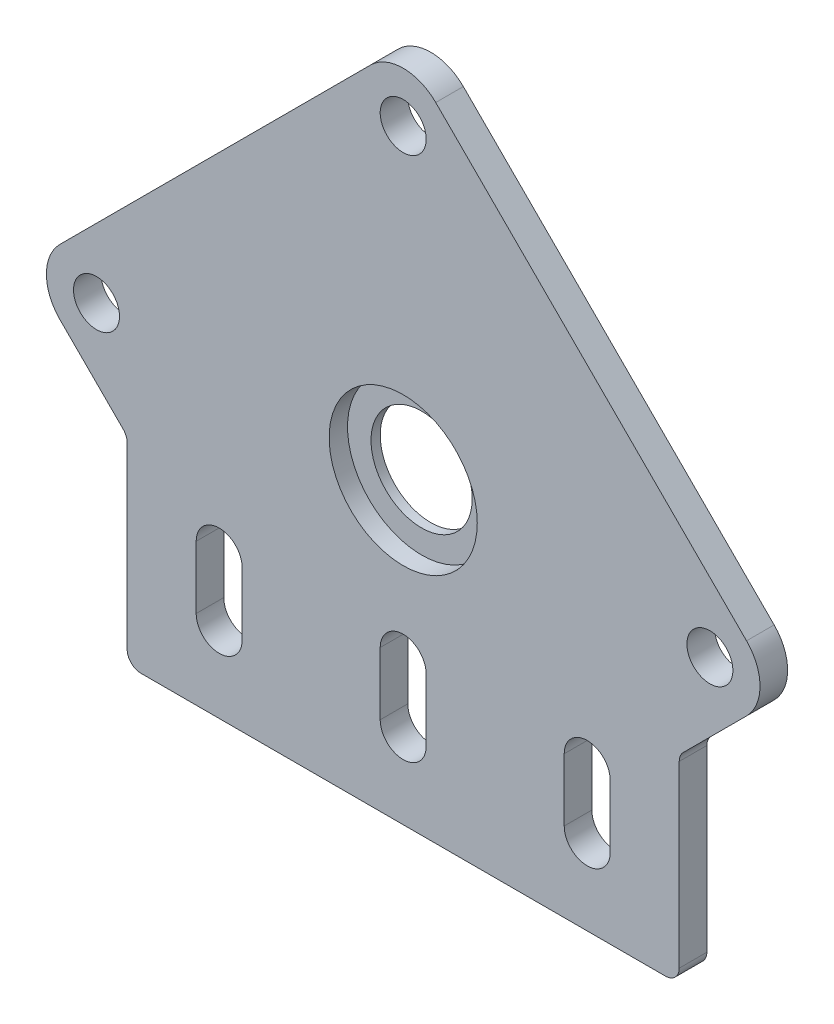
ISO-10303-21;
HEADER;
FILE_DESCRIPTION(('STEP AP214'),'2;1');
FILE_NAME('part.step','',(''),(''),'','','');
FILE_SCHEMA(('AUTOMOTIVE_DESIGN { 1 0 10303 214 1 1 1 1 }'));
ENDSEC;
DATA;
#1=APPLICATION_CONTEXT('core data for automotive mechanical design processes');
#2=APPLICATION_PROTOCOL_DEFINITION('international standard','automotive_design',2000,#1);
#3=PRODUCT_CONTEXT('',#1,'mechanical');
#4=PRODUCT('Part','Part','',(#3));
#5=PRODUCT_RELATED_PRODUCT_CATEGORY('part','',(#4));
#6=PRODUCT_DEFINITION_FORMATION('','',#4);
#7=PRODUCT_DEFINITION_CONTEXT('part definition',#1,'design');
#8=PRODUCT_DEFINITION('design','',#6,#7);
#9=PRODUCT_DEFINITION_SHAPE('','',#8);
#10=(LENGTH_UNIT() NAMED_UNIT(*) SI_UNIT(.MILLI.,.METRE.));
#11=(NAMED_UNIT(*) PLANE_ANGLE_UNIT() SI_UNIT($,.RADIAN.));
#12=(NAMED_UNIT(*) SI_UNIT($,.STERADIAN.) SOLID_ANGLE_UNIT());
#13=UNCERTAINTY_MEASURE_WITH_UNIT(LENGTH_MEASURE(1.E-05),#10,'distance_accuracy_value','');
#14=(GEOMETRIC_REPRESENTATION_CONTEXT(3) GLOBAL_UNCERTAINTY_ASSIGNED_CONTEXT((#13)) GLOBAL_UNIT_ASSIGNED_CONTEXT((#10,
#11,#12)) REPRESENTATION_CONTEXT('',''));
#15=CARTESIAN_POINT('',(0.,0.,0.));
#16=DIRECTION('',(0.,0.,1.));
#17=DIRECTION('',(1.,0.,0.));
#18=AXIS2_PLACEMENT_3D('',#15,#16,#17);
#19=CARTESIAN_POINT('',(0.,32.4299999999672,3.));
#20=DIRECTION('',(0.,0.,-1.));
#21=DIRECTION('',(-1.,0.,0.));
#22=AXIS2_PLACEMENT_3D('',#19,#20,#21);
#23=CYLINDRICAL_SURFACE('',#22,5.50000000000001);
#24=CARTESIAN_POINT('',(0.,32.4299999999672,0.));
#25=DIRECTION('',(0.,0.,1.));
#26=DIRECTION('',(1.,0.,0.));
#27=AXIS2_PLACEMENT_3D('',#24,#25,#26);
#28=CIRCLE('',#27,5.50000000000001);
#29=CARTESIAN_POINT('',(5.50000000000001,32.4299999999672,0.));
#30=VERTEX_POINT('',#29);
#31=EDGE_CURVE('E322',#30,#30,#28,.T.);
#32=ORIENTED_EDGE('',*,*,#31,.F.);
#33=EDGE_LOOP('',(#32));
#34=FACE_BOUND('',#33,.T.);
#35=CARTESIAN_POINT('',(0.,32.4299999999672,1.));
#36=DIRECTION('',(0.,0.,1.));
#37=DIRECTION('',(1.,0.,0.));
#38=AXIS2_PLACEMENT_3D('',#35,#36,#37);
#39=CIRCLE('',#38,5.50000000000001);
#40=CARTESIAN_POINT('',(5.50000000000001,32.4299999999672,1.));
#41=VERTEX_POINT('',#40);
#42=EDGE_CURVE('E37',#41,#41,#39,.T.);
#43=ORIENTED_EDGE('',*,*,#42,.T.);
#44=EDGE_LOOP('',(#43));
#45=FACE_BOUND('',#44,.T.);
#46=ADVANCED_FACE('F33',(#34,#45),#23,.F.);
#47=CARTESIAN_POINT('',(28.5000000000561,1.5,3.));
#48=DIRECTION('',(0.,0.,-1.));
#49=DIRECTION('',(-1.,0.,0.));
#50=AXIS2_PLACEMENT_3D('',#47,#48,#49);
#51=PLANE('',#50);
#52=CARTESIAN_POINT('',(0.,32.4299999999672,3.));
#53=DIRECTION('',(0.,0.,1.));
#54=DIRECTION('',(1.,0.,0.));
#55=AXIS2_PLACEMENT_3D('',#52,#53,#54);
#56=CIRCLE('',#55,8.05000000000959);
#57=CARTESIAN_POINT('',(8.05000000000959,32.4299999999672,3.));
#58=VERTEX_POINT('',#57);
#59=EDGE_CURVE('E804',#58,#58,#56,.T.);
#60=ORIENTED_EDGE('',*,*,#59,.F.);
#61=EDGE_LOOP('',(#60));
#62=FACE_BOUND('',#61,.T.);
#63=CARTESIAN_POINT('',(33.333,32.4299999999672,3.));
#64=DIRECTION('',(0.,0.,1.));
#65=DIRECTION('',(-1.,0.,0.));
#66=AXIS2_PLACEMENT_3D('',#63,#64,#65);
#67=CIRCLE('',#66,2.50000000000959);
#68=CARTESIAN_POINT('',(30.8329999999904,32.4299999999672,3.));
#69=VERTEX_POINT('',#68);
#70=EDGE_CURVE('E245',#69,#69,#67,.T.);
#71=ORIENTED_EDGE('',*,*,#70,.F.);
#72=EDGE_LOOP('',(#71));
#73=FACE_BOUND('',#72,.T.);
#74=CARTESIAN_POINT('',(-20.,8.63,3.));
#75=DIRECTION('',(0.,0.,1.));
#76=DIRECTION('',(1.,0.,0.));
#77=AXIS2_PLACEMENT_3D('',#74,#75,#76);
#78=CIRCLE('',#77,2.5);
#79=CARTESIAN_POINT('',(-22.5,8.63,3.));
#80=VERTEX_POINT('',#79);
#81=CARTESIAN_POINT('',(-17.5,8.63,3.));
#82=VERTEX_POINT('',#81);
#83=EDGE_CURVE('E251',#80,#82,#78,.T.);
#84=ORIENTED_EDGE('',*,*,#83,.F.);
#85=DIRECTION('',(0.,-1.,0.));
#86=VECTOR('',#85,1.);
#87=CARTESIAN_POINT('',(-22.5,8.63,3.));
#88=LINE('',#87,#86);
#89=CARTESIAN_POINT('',(-22.5,15.43,3.));
#90=VERTEX_POINT('',#89);
#91=EDGE_CURVE('E259',#90,#80,#88,.T.);
#92=ORIENTED_EDGE('',*,*,#91,.F.);
#93=CARTESIAN_POINT('',(-20.,15.43,3.));
#94=DIRECTION('',(0.,0.,1.));
#95=DIRECTION('',(1.,0.,0.));
#96=AXIS2_PLACEMENT_3D('',#93,#94,#95);
#97=CIRCLE('',#96,2.5);
#98=CARTESIAN_POINT('',(-17.5,15.43,3.));
#99=VERTEX_POINT('',#98);
#100=EDGE_CURVE('E256',#99,#90,#97,.T.);
#101=ORIENTED_EDGE('',*,*,#100,.F.);
#102=DIRECTION('',(0.,1.,0.));
#103=VECTOR('',#102,1.);
#104=CARTESIAN_POINT('',(-17.5,8.63,3.));
#105=LINE('',#104,#103);
#106=EDGE_CURVE('E253',#82,#99,#105,.T.);
#107=ORIENTED_EDGE('',*,*,#106,.F.);
#108=EDGE_LOOP('',(#84,#92,#101,#107));
#109=FACE_BOUND('',#108,.T.);
#110=CARTESIAN_POINT('',(-33.333,32.4299999999672,3.));
#111=DIRECTION('',(0.,0.,1.));
#112=DIRECTION('',(1.,0.,0.));
#113=AXIS2_PLACEMENT_3D('',#110,#111,#112);
#114=CIRCLE('',#113,2.50000000000959);
#115=CARTESIAN_POINT('',(-30.8329999999904,32.4299999999672,3.));
#116=VERTEX_POINT('',#115);
#117=EDGE_CURVE('E313',#116,#116,#114,.T.);
#118=ORIENTED_EDGE('',*,*,#117,.F.);
#119=EDGE_LOOP('',(#118));
#120=FACE_BOUND('',#119,.T.);
#121=CARTESIAN_POINT('',(0.,65.7630273303,3.));
#122=DIRECTION('',(0.,0.,1.));
#123=DIRECTION('',(1.,0.,0.));
#124=AXIS2_PLACEMENT_3D('',#121,#122,#123);
#125=CIRCLE('',#124,2.5);
#126=CARTESIAN_POINT('',(2.5,65.7630273303,3.));
#127=VERTEX_POINT('',#126);
#128=EDGE_CURVE('E319',#127,#127,#125,.T.);
#129=ORIENTED_EDGE('',*,*,#128,.F.);
#130=EDGE_LOOP('',(#129));
#131=FACE_BOUND('',#130,.T.);
#132=CARTESIAN_POINT('',(28.5000000000561,1.5,3.));
#133=DIRECTION('',(0.,0.,1.));
#134=DIRECTION('',(-1.,0.,0.));
#135=AXIS2_PLACEMENT_3D('',#132,#133,#134);
#136=CIRCLE('',#135,1.5);
#137=CARTESIAN_POINT('',(28.5000000000561,0.,3.));
#138=VERTEX_POINT('',#137);
#139=CARTESIAN_POINT('',(30.0000000000561,1.5,3.));
#140=VERTEX_POINT('',#139);
#141=EDGE_CURVE('E328',#138,#140,#136,.T.);
#142=ORIENTED_EDGE('',*,*,#141,.T.);
#143=DIRECTION('',(0.,1.,0.));
#144=VECTOR('',#143,1.);
#145=CARTESIAN_POINT('',(30.0000000000561,20.9591209072809,3.));
#146=LINE('',#145,#144);
#147=CARTESIAN_POINT('',(30.0000000000561,20.9591209072809,3.));
#148=VERTEX_POINT('',#147);
#149=EDGE_CURVE('E331',#140,#148,#146,.T.);
#150=ORIENTED_EDGE('',*,*,#149,.T.);
#151=CARTESIAN_POINT('',(31.5000000000561,20.9591209072809,3.));
#152=DIRECTION('',(0.,0.,-1.));
#153=DIRECTION('',(-1.,0.,0.));
#154=AXIS2_PLACEMENT_3D('',#151,#152,#153);
#155=CIRCLE('',#154,1.5);
#156=CARTESIAN_POINT('',(30.4393398282763,22.0197810790608,3.));
#157=VERTEX_POINT('',#156);
#158=EDGE_CURVE('E334',#148,#157,#155,.T.);
#159=ORIENTED_EDGE('',*,*,#158,.T.);
#160=DIRECTION('',(0.707106781186546,0.707106781186549,0.));
#161=VECTOR('',#160,1.);
#162=CARTESIAN_POINT('',(37.31402484325,28.8944660940345,3.));
#163=LINE('',#162,#161);
#164=CARTESIAN_POINT('',(37.31402484325,28.8944660940345,3.));
#165=VERTEX_POINT('',#164);
#166=EDGE_CURVE('E336',#157,#165,#163,.T.);
#167=ORIENTED_EDGE('',*,*,#166,.T.);
#168=CARTESIAN_POINT('',(33.7784909373173,32.4299999999672,3.));
#169=DIRECTION('',(0.,0.,1.));
#170=DIRECTION('',(-1.,0.,0.));
#171=AXIS2_PLACEMENT_3D('',#168,#169,#170);
#172=CIRCLE('',#171,4.99999999999998);
#173=CARTESIAN_POINT('',(37.31402484325,35.9655339058999,3.));
#174=VERTEX_POINT('',#173);
#175=EDGE_CURVE('E338',#165,#174,#172,.T.);
#176=ORIENTED_EDGE('',*,*,#175,.T.);
#177=DIRECTION('',(-0.707106781186547,0.707106781186548,0.));
#178=VECTOR('',#177,1.);
#179=CARTESIAN_POINT('',(3.53553390593274,69.7440248432172,3.));
#180=LINE('',#179,#178);
#181=CARTESIAN_POINT('',(3.53553390593274,69.7440248432172,3.));
#182=VERTEX_POINT('',#181);
#183=EDGE_CURVE('E340',#174,#182,#180,.T.);
#184=ORIENTED_EDGE('',*,*,#183,.T.);
#185=CARTESIAN_POINT('',(0.,66.2084909372845,3.));
#186=DIRECTION('',(0.,0.,1.));
#187=DIRECTION('',(1.,0.,0.));
#188=AXIS2_PLACEMENT_3D('',#185,#186,#187);
#189=CIRCLE('',#188,5.);
#190=CARTESIAN_POINT('',(-3.53553390593275,69.7440248432172,3.));
#191=VERTEX_POINT('',#190);
#192=EDGE_CURVE('E342',#182,#191,#189,.T.);
#193=ORIENTED_EDGE('',*,*,#192,.T.);
#194=DIRECTION('',(-0.707106781186547,-0.707106781186548,0.));
#195=VECTOR('',#194,1.);
#196=CARTESIAN_POINT('',(-3.53553390593276,69.7440248432172,3.));
#197=LINE('',#196,#195);
#198=CARTESIAN_POINT('',(-37.31402484325,35.9655339059,3.));
#199=VERTEX_POINT('',#198);
#200=EDGE_CURVE('E344',#191,#199,#197,.T.);
#201=ORIENTED_EDGE('',*,*,#200,.T.);
#202=CARTESIAN_POINT('',(-33.7784909373173,32.4299999999672,3.));
#203=DIRECTION('',(0.,0.,1.));
#204=DIRECTION('',(1.,0.,0.));
#205=AXIS2_PLACEMENT_3D('',#202,#203,#204);
#206=CIRCLE('',#205,4.99999999999999);
#207=CARTESIAN_POINT('',(-37.31402484325,28.8944660940345,3.));
#208=VERTEX_POINT('',#207);
#209=EDGE_CURVE('E346',#199,#208,#206,.T.);
#210=ORIENTED_EDGE('',*,*,#209,.T.);
#211=DIRECTION('',(0.707106781186548,-0.707106781186547,0.));
#212=VECTOR('',#211,1.);
#213=CARTESIAN_POINT('',(-37.31402484325,28.8944660940345,3.));
#214=LINE('',#213,#212);
#215=CARTESIAN_POINT('',(-30.4393398282763,22.0197810790608,3.));
#216=VERTEX_POINT('',#215);
#217=EDGE_CURVE('E348',#208,#216,#214,.T.);
#218=ORIENTED_EDGE('',*,*,#217,.T.);
#219=CARTESIAN_POINT('',(-31.5000000000561,20.9591209072809,3.));
#220=DIRECTION('',(0.,0.,-1.));
#221=DIRECTION('',(1.,0.,0.));
#222=AXIS2_PLACEMENT_3D('',#219,#220,#221);
#223=CIRCLE('',#222,1.5);
#224=CARTESIAN_POINT('',(-30.0000000000561,20.9591209072809,3.));
#225=VERTEX_POINT('',#224);
#226=EDGE_CURVE('E350',#216,#225,#223,.T.);
#227=ORIENTED_EDGE('',*,*,#226,.T.);
#228=DIRECTION('',(0.,-1.,0.));
#229=VECTOR('',#228,1.);
#230=CARTESIAN_POINT('',(-30.0000000000561,20.9591209072809,3.));
#231=LINE('',#230,#229);
#232=CARTESIAN_POINT('',(-30.0000000000561,1.5,3.));
#233=VERTEX_POINT('',#232);
#234=EDGE_CURVE('E352',#225,#233,#231,.T.);
#235=ORIENTED_EDGE('',*,*,#234,.T.);
#236=CARTESIAN_POINT('',(-28.5000000000561,1.5,3.));
#237=DIRECTION('',(0.,0.,1.));
#238=DIRECTION('',(1.,0.,0.));
#239=AXIS2_PLACEMENT_3D('',#236,#237,#238);
#240=CIRCLE('',#239,1.5);
#241=CARTESIAN_POINT('',(-28.5000000000561,0.,3.));
#242=VERTEX_POINT('',#241);
#243=EDGE_CURVE('E354',#233,#242,#240,.T.);
#244=ORIENTED_EDGE('',*,*,#243,.T.);
#245=DIRECTION('',(1.,0.,0.));
#246=VECTOR('',#245,1.);
#247=CARTESIAN_POINT('',(-28.5000000000561,0.,3.));
#248=LINE('',#247,#246);
#249=EDGE_CURVE('E356',#242,#138,#248,.T.);
#250=ORIENTED_EDGE('',*,*,#249,.T.);
#251=EDGE_LOOP('',(#142,#150,#159,#167,#176,#184,#193,#201,#210,#218,#227,#235,#244,#250));
#252=FACE_BOUND('',#251,.T.);
#253=CARTESIAN_POINT('',(20.,8.63,3.));
#254=DIRECTION('',(0.,0.,1.));
#255=DIRECTION('',(-1.,0.,0.));
#256=AXIS2_PLACEMENT_3D('',#253,#254,#255);
#257=CIRCLE('',#256,2.5);
#258=CARTESIAN_POINT('',(17.5,8.63,3.));
#259=VERTEX_POINT('',#258);
#260=CARTESIAN_POINT('',(22.5,8.63,3.));
#261=VERTEX_POINT('',#260);
#262=EDGE_CURVE('E282',#259,#261,#257,.T.);
#263=ORIENTED_EDGE('',*,*,#262,.F.);
#264=DIRECTION('',(0.,-1.,0.));
#265=VECTOR('',#264,1.);
#266=CARTESIAN_POINT('',(17.5,8.63,3.));
#267=LINE('',#266,#265);
#268=CARTESIAN_POINT('',(17.5,15.43,3.));
#269=VERTEX_POINT('',#268);
#270=EDGE_CURVE('E290',#269,#259,#267,.T.);
#271=ORIENTED_EDGE('',*,*,#270,.F.);
#272=CARTESIAN_POINT('',(20.,15.43,3.));
#273=DIRECTION('',(0.,0.,1.));
#274=DIRECTION('',(-1.,0.,0.));
#275=AXIS2_PLACEMENT_3D('',#272,#273,#274);
#276=CIRCLE('',#275,2.5);
#277=CARTESIAN_POINT('',(22.5,15.43,3.));
#278=VERTEX_POINT('',#277);
#279=EDGE_CURVE('E287',#278,#269,#276,.T.);
#280=ORIENTED_EDGE('',*,*,#279,.F.);
#281=DIRECTION('',(0.,1.,0.));
#282=VECTOR('',#281,1.);
#283=CARTESIAN_POINT('',(22.5,8.63,3.));
#284=LINE('',#283,#282);
#285=EDGE_CURVE('E284',#261,#278,#284,.T.);
#286=ORIENTED_EDGE('',*,*,#285,.F.);
#287=EDGE_LOOP('',(#263,#271,#280,#286));
#288=FACE_BOUND('',#287,.T.);
#289=CARTESIAN_POINT('',(0.,8.63,3.));
#290=DIRECTION('',(0.,0.,1.));
#291=DIRECTION('',(1.,0.,0.));
#292=AXIS2_PLACEMENT_3D('',#289,#290,#291);
#293=CIRCLE('',#292,2.5);
#294=CARTESIAN_POINT('',(-2.5,8.63,3.));
#295=VERTEX_POINT('',#294);
#296=CARTESIAN_POINT('',(2.5,8.63,3.));
#297=VERTEX_POINT('',#296);
#298=EDGE_CURVE('E207',#295,#297,#293,.T.);
#299=ORIENTED_EDGE('',*,*,#298,.F.);
#300=DIRECTION('',(0.,-1.,0.));
#301=VECTOR('',#300,1.);
#302=CARTESIAN_POINT('',(-2.5,8.63,3.));
#303=LINE('',#302,#301);
#304=CARTESIAN_POINT('',(-2.5,15.43,3.));
#305=VERTEX_POINT('',#304);
#306=EDGE_CURVE('E230',#305,#295,#303,.T.);
#307=ORIENTED_EDGE('',*,*,#306,.F.);
#308=CARTESIAN_POINT('',(0.,15.43,3.));
#309=DIRECTION('',(0.,0.,1.));
#310=DIRECTION('',(1.,0.,0.));
#311=AXIS2_PLACEMENT_3D('',#308,#309,#310);
#312=CIRCLE('',#311,2.5);
#313=CARTESIAN_POINT('',(2.5,15.43,3.));
#314=VERTEX_POINT('',#313);
#315=EDGE_CURVE('E228',#314,#305,#312,.T.);
#316=ORIENTED_EDGE('',*,*,#315,.F.);
#317=DIRECTION('',(0.,1.,0.));
#318=VECTOR('',#317,1.);
#319=CARTESIAN_POINT('',(2.5,8.63,3.));
#320=LINE('',#319,#318);
#321=EDGE_CURVE('E215',#297,#314,#320,.T.);
#322=ORIENTED_EDGE('',*,*,#321,.F.);
#323=EDGE_LOOP('',(#299,#307,#316,#322));
#324=FACE_BOUND('',#323,.T.);
#325=ADVANCED_FACE('F227',(#62,#73,#109,#120,#131,#252,#288,#324),#51,.F.);
#326=CARTESIAN_POINT('',(28.5000000000561,1.5,0.));
#327=DIRECTION('',(0.,0.,-1.));
#328=DIRECTION('',(-1.,0.,0.));
#329=AXIS2_PLACEMENT_3D('',#326,#327,#328);
#330=PLANE('',#329);
#331=DIRECTION('',(0.,-1.,0.));
#332=VECTOR('',#331,1.);
#333=CARTESIAN_POINT('',(-22.5,8.63,0.));
#334=LINE('',#333,#332);
#335=CARTESIAN_POINT('',(-22.5,15.43,0.));
#336=VERTEX_POINT('',#335);
#337=CARTESIAN_POINT('',(-22.5,8.63,0.));
#338=VERTEX_POINT('',#337);
#339=EDGE_CURVE('E254',#336,#338,#334,.T.);
#340=ORIENTED_EDGE('',*,*,#339,.T.);
#341=CARTESIAN_POINT('',(-20.,8.63,0.));
#342=DIRECTION('',(0.,0.,1.));
#343=DIRECTION('',(1.,0.,0.));
#344=AXIS2_PLACEMENT_3D('',#341,#342,#343);
#345=CIRCLE('',#344,2.5);
#346=CARTESIAN_POINT('',(-17.5,8.63,0.));
#347=VERTEX_POINT('',#346);
#348=EDGE_CURVE('E248',#338,#347,#345,.T.);
#349=ORIENTED_EDGE('',*,*,#348,.T.);
#350=DIRECTION('',(0.,1.,0.));
#351=VECTOR('',#350,1.);
#352=CARTESIAN_POINT('',(-17.5,8.63,0.));
#353=LINE('',#352,#351);
#354=CARTESIAN_POINT('',(-17.5,15.43,0.));
#355=VERTEX_POINT('',#354);
#356=EDGE_CURVE('E264',#347,#355,#353,.T.);
#357=ORIENTED_EDGE('',*,*,#356,.T.);
#358=CARTESIAN_POINT('',(-20.,15.43,0.));
#359=DIRECTION('',(0.,0.,1.));
#360=DIRECTION('',(1.,0.,0.));
#361=AXIS2_PLACEMENT_3D('',#358,#359,#360);
#362=CIRCLE('',#361,2.5);
#363=EDGE_CURVE('E267',#355,#336,#362,.T.);
#364=ORIENTED_EDGE('',*,*,#363,.T.);
#365=EDGE_LOOP('',(#340,#349,#357,#364));
#366=FACE_BOUND('',#365,.T.);
#367=DIRECTION('',(0.,-1.,0.));
#368=VECTOR('',#367,1.);
#369=CARTESIAN_POINT('',(17.5,8.63,0.));
#370=LINE('',#369,#368);
#371=CARTESIAN_POINT('',(17.5,15.43,0.));
#372=VERTEX_POINT('',#371);
#373=CARTESIAN_POINT('',(17.5,8.63,0.));
#374=VERTEX_POINT('',#373);
#375=EDGE_CURVE('E285',#372,#374,#370,.T.);
#376=ORIENTED_EDGE('',*,*,#375,.T.);
#377=CARTESIAN_POINT('',(20.,8.63,0.));
#378=DIRECTION('',(0.,0.,1.));
#379=DIRECTION('',(-1.,0.,0.));
#380=AXIS2_PLACEMENT_3D('',#377,#378,#379);
#381=CIRCLE('',#380,2.5);
#382=CARTESIAN_POINT('',(22.5,8.63,0.));
#383=VERTEX_POINT('',#382);
#384=EDGE_CURVE('E281',#374,#383,#381,.T.);
#385=ORIENTED_EDGE('',*,*,#384,.T.);
#386=DIRECTION('',(0.,1.,0.));
#387=VECTOR('',#386,1.);
#388=CARTESIAN_POINT('',(22.5,8.63,0.));
#389=LINE('',#388,#387);
#390=CARTESIAN_POINT('',(22.5,15.43,0.));
#391=VERTEX_POINT('',#390);
#392=EDGE_CURVE('E295',#383,#391,#389,.T.);
#393=ORIENTED_EDGE('',*,*,#392,.T.);
#394=CARTESIAN_POINT('',(20.,15.43,0.));
#395=DIRECTION('',(0.,0.,1.));
#396=DIRECTION('',(-1.,0.,0.));
#397=AXIS2_PLACEMENT_3D('',#394,#395,#396);
#398=CIRCLE('',#397,2.5);
#399=EDGE_CURVE('E298',#391,#372,#398,.T.);
#400=ORIENTED_EDGE('',*,*,#399,.T.);
#401=EDGE_LOOP('',(#376,#385,#393,#400));
#402=FACE_BOUND('',#401,.T.);
#403=CARTESIAN_POINT('',(-33.333,32.4299999999672,0.));
#404=DIRECTION('',(0.,0.,1.));
#405=DIRECTION('',(1.,0.,0.));
#406=AXIS2_PLACEMENT_3D('',#403,#404,#405);
#407=CIRCLE('',#406,2.50000000000959);
#408=CARTESIAN_POINT('',(-30.8329999999904,32.4299999999672,0.));
#409=VERTEX_POINT('',#408);
#410=EDGE_CURVE('E312',#409,#409,#407,.T.);
#411=ORIENTED_EDGE('',*,*,#410,.T.);
#412=EDGE_LOOP('',(#411));
#413=FACE_BOUND('',#412,.T.);
#414=ORIENTED_EDGE('',*,*,#31,.T.);
#415=EDGE_LOOP('',(#414));
#416=FACE_BOUND('',#415,.T.);
#417=CARTESIAN_POINT('',(28.5000000000561,1.5,0.));
#418=DIRECTION('',(0.,0.,1.));
#419=DIRECTION('',(-1.,0.,0.));
#420=AXIS2_PLACEMENT_3D('',#417,#418,#419);
#421=CIRCLE('',#420,1.5);
#422=CARTESIAN_POINT('',(28.5000000000561,0.,0.));
#423=VERTEX_POINT('',#422);
#424=CARTESIAN_POINT('',(30.0000000000561,1.5,0.));
#425=VERTEX_POINT('',#424);
#426=EDGE_CURVE('E327',#423,#425,#421,.T.);
#427=ORIENTED_EDGE('',*,*,#426,.F.);
#428=DIRECTION('',(1.,0.,0.));
#429=VECTOR('',#428,1.);
#430=CARTESIAN_POINT('',(-28.5000000000561,0.,0.));
#431=LINE('',#430,#429);
#432=CARTESIAN_POINT('',(-28.5000000000561,0.,0.));
#433=VERTEX_POINT('',#432);
#434=EDGE_CURVE('E332',#433,#423,#431,.T.);
#435=ORIENTED_EDGE('',*,*,#434,.F.);
#436=CARTESIAN_POINT('',(-28.5000000000561,1.5,0.));
#437=DIRECTION('',(0.,0.,1.));
#438=DIRECTION('',(1.,0.,0.));
#439=AXIS2_PLACEMENT_3D('',#436,#437,#438);
#440=CIRCLE('',#439,1.5);
#441=CARTESIAN_POINT('',(-30.0000000000561,1.5,0.));
#442=VERTEX_POINT('',#441);
#443=EDGE_CURVE('E383',#442,#433,#440,.T.);
#444=ORIENTED_EDGE('',*,*,#443,.F.);
#445=DIRECTION('',(0.,-1.,0.));
#446=VECTOR('',#445,1.);
#447=CARTESIAN_POINT('',(-30.0000000000561,20.9591209072809,0.));
#448=LINE('',#447,#446);
#449=CARTESIAN_POINT('',(-30.0000000000561,20.9591209072809,0.));
#450=VERTEX_POINT('',#449);
#451=EDGE_CURVE('E381',#450,#442,#448,.T.);
#452=ORIENTED_EDGE('',*,*,#451,.F.);
#453=CARTESIAN_POINT('',(-31.5000000000561,20.9591209072809,0.));
#454=DIRECTION('',(0.,0.,-1.));
#455=DIRECTION('',(1.,0.,0.));
#456=AXIS2_PLACEMENT_3D('',#453,#454,#455);
#457=CIRCLE('',#456,1.5);
#458=CARTESIAN_POINT('',(-30.4393398282763,22.0197810790608,0.));
#459=VERTEX_POINT('',#458);
#460=EDGE_CURVE('E379',#459,#450,#457,.T.);
#461=ORIENTED_EDGE('',*,*,#460,.F.);
#462=DIRECTION('',(0.707106781186548,-0.707106781186547,0.));
#463=VECTOR('',#462,1.);
#464=CARTESIAN_POINT('',(-37.31402484325,28.8944660940345,0.));
#465=LINE('',#464,#463);
#466=CARTESIAN_POINT('',(-37.31402484325,28.8944660940345,0.));
#467=VERTEX_POINT('',#466);
#468=EDGE_CURVE('E377',#467,#459,#465,.T.);
#469=ORIENTED_EDGE('',*,*,#468,.F.);
#470=CARTESIAN_POINT('',(-33.7784909373173,32.4299999999672,0.));
#471=DIRECTION('',(0.,0.,1.));
#472=DIRECTION('',(1.,0.,0.));
#473=AXIS2_PLACEMENT_3D('',#470,#471,#472);
#474=CIRCLE('',#473,4.99999999999999);
#475=CARTESIAN_POINT('',(-37.31402484325,35.9655339059,0.));
#476=VERTEX_POINT('',#475);
#477=EDGE_CURVE('E375',#476,#467,#474,.T.);
#478=ORIENTED_EDGE('',*,*,#477,.F.);
#479=DIRECTION('',(-0.707106781186547,-0.707106781186548,0.));
#480=VECTOR('',#479,1.);
#481=CARTESIAN_POINT('',(-3.53553390593276,69.7440248432172,0.));
#482=LINE('',#481,#480);
#483=CARTESIAN_POINT('',(-3.53553390593275,69.7440248432172,0.));
#484=VERTEX_POINT('',#483);
#485=EDGE_CURVE('E373',#484,#476,#482,.T.);
#486=ORIENTED_EDGE('',*,*,#485,.F.);
#487=CARTESIAN_POINT('',(0.,66.2084909372845,0.));
#488=DIRECTION('',(0.,0.,1.));
#489=DIRECTION('',(1.,0.,0.));
#490=AXIS2_PLACEMENT_3D('',#487,#488,#489);
#491=CIRCLE('',#490,5.);
#492=CARTESIAN_POINT('',(3.53553390593274,69.7440248432172,0.));
#493=VERTEX_POINT('',#492);
#494=EDGE_CURVE('E371',#493,#484,#491,.T.);
#495=ORIENTED_EDGE('',*,*,#494,.F.);
#496=DIRECTION('',(-0.707106781186547,0.707106781186548,0.));
#497=VECTOR('',#496,1.);
#498=CARTESIAN_POINT('',(3.53553390593274,69.7440248432172,0.));
#499=LINE('',#498,#497);
#500=CARTESIAN_POINT('',(37.31402484325,35.9655339058999,0.));
#501=VERTEX_POINT('',#500);
#502=EDGE_CURVE('E369',#501,#493,#499,.T.);
#503=ORIENTED_EDGE('',*,*,#502,.F.);
#504=CARTESIAN_POINT('',(33.7784909373173,32.4299999999672,0.));
#505=DIRECTION('',(0.,0.,1.));
#506=DIRECTION('',(-1.,0.,0.));
#507=AXIS2_PLACEMENT_3D('',#504,#505,#506);
#508=CIRCLE('',#507,4.99999999999998);
#509=CARTESIAN_POINT('',(37.31402484325,28.8944660940345,0.));
#510=VERTEX_POINT('',#509);
#511=EDGE_CURVE('E367',#510,#501,#508,.T.);
#512=ORIENTED_EDGE('',*,*,#511,.F.);
#513=DIRECTION('',(0.707106781186546,0.707106781186549,0.));
#514=VECTOR('',#513,1.);
#515=CARTESIAN_POINT('',(37.31402484325,28.8944660940345,0.));
#516=LINE('',#515,#514);
#517=CARTESIAN_POINT('',(30.4393398282763,22.0197810790608,0.));
#518=VERTEX_POINT('',#517);
#519=EDGE_CURVE('E365',#518,#510,#516,.T.);
#520=ORIENTED_EDGE('',*,*,#519,.F.);
#521=CARTESIAN_POINT('',(31.5000000000561,20.9591209072809,0.));
#522=DIRECTION('',(0.,0.,-1.));
#523=DIRECTION('',(-1.,0.,0.));
#524=AXIS2_PLACEMENT_3D('',#521,#522,#523);
#525=CIRCLE('',#524,1.5);
#526=CARTESIAN_POINT('',(30.0000000000561,20.9591209072809,0.));
#527=VERTEX_POINT('',#526);
#528=EDGE_CURVE('E363',#527,#518,#525,.T.);
#529=ORIENTED_EDGE('',*,*,#528,.F.);
#530=DIRECTION('',(0.,1.,0.));
#531=VECTOR('',#530,1.);
#532=CARTESIAN_POINT('',(30.0000000000561,20.9591209072809,0.));
#533=LINE('',#532,#531);
#534=EDGE_CURVE('E361',#425,#527,#533,.T.);
#535=ORIENTED_EDGE('',*,*,#534,.F.);
#536=EDGE_LOOP('',(#427,#435,#444,#452,#461,#469,#478,#486,#495,#503,#512,#520,#529,#535));
#537=FACE_BOUND('',#536,.T.);
#538=CARTESIAN_POINT('',(0.,65.7630273303,0.));
#539=DIRECTION('',(0.,0.,1.));
#540=DIRECTION('',(1.,0.,0.));
#541=AXIS2_PLACEMENT_3D('',#538,#539,#540);
#542=CIRCLE('',#541,2.5);
#543=CARTESIAN_POINT('',(2.5,65.7630273303,0.));
#544=VERTEX_POINT('',#543);
#545=EDGE_CURVE('E316',#544,#544,#542,.T.);
#546=ORIENTED_EDGE('',*,*,#545,.T.);
#547=EDGE_LOOP('',(#546));
#548=FACE_BOUND('',#547,.T.);
#549=CARTESIAN_POINT('',(33.333,32.4299999999672,0.));
#550=DIRECTION('',(0.,0.,1.));
#551=DIRECTION('',(-1.,0.,0.));
#552=AXIS2_PLACEMENT_3D('',#549,#550,#551);
#553=CIRCLE('',#552,2.50000000000959);
#554=CARTESIAN_POINT('',(30.8329999999904,32.4299999999672,0.));
#555=VERTEX_POINT('',#554);
#556=EDGE_CURVE('E223',#555,#555,#553,.T.);
#557=ORIENTED_EDGE('',*,*,#556,.T.);
#558=EDGE_LOOP('',(#557));
#559=FACE_BOUND('',#558,.T.);
#560=DIRECTION('',(0.,-1.,0.));
#561=VECTOR('',#560,1.);
#562=CARTESIAN_POINT('',(-2.5,8.63,0.));
#563=LINE('',#562,#561);
#564=CARTESIAN_POINT('',(-2.5,15.43,0.));
#565=VERTEX_POINT('',#564);
#566=CARTESIAN_POINT('',(-2.5,8.63,0.));
#567=VERTEX_POINT('',#566);
#568=EDGE_CURVE('E216',#565,#567,#563,.T.);
#569=ORIENTED_EDGE('',*,*,#568,.T.);
#570=CARTESIAN_POINT('',(0.,8.63,0.));
#571=DIRECTION('',(0.,0.,1.));
#572=DIRECTION('',(1.,0.,0.));
#573=AXIS2_PLACEMENT_3D('',#570,#571,#572);
#574=CIRCLE('',#573,2.5);
#575=CARTESIAN_POINT('',(2.5,8.63,0.));
#576=VERTEX_POINT('',#575);
#577=EDGE_CURVE('E57',#567,#576,#574,.T.);
#578=ORIENTED_EDGE('',*,*,#577,.T.);
#579=DIRECTION('',(0.,1.,0.));
#580=VECTOR('',#579,1.);
#581=CARTESIAN_POINT('',(2.5,8.63,0.));
#582=LINE('',#581,#580);
#583=CARTESIAN_POINT('',(2.5,15.43,0.));
#584=VERTEX_POINT('',#583);
#585=EDGE_CURVE('E222',#576,#584,#582,.T.);
#586=ORIENTED_EDGE('',*,*,#585,.T.);
#587=CARTESIAN_POINT('',(0.,15.43,0.));
#588=DIRECTION('',(0.,0.,1.));
#589=DIRECTION('',(1.,0.,0.));
#590=AXIS2_PLACEMENT_3D('',#587,#588,#589);
#591=CIRCLE('',#590,2.5);
#592=EDGE_CURVE('E237',#584,#565,#591,.T.);
#593=ORIENTED_EDGE('',*,*,#592,.T.);
#594=EDGE_LOOP('',(#569,#578,#586,#593));
#595=FACE_BOUND('',#594,.T.);
#596=ADVANCED_FACE('F432',(#366,#402,#413,#416,#537,#548,#559,#595),#330,.T.);
#597=CARTESIAN_POINT('',(28.5000000000561,1.5,3.));
#598=DIRECTION('',(0.,0.,-1.));
#599=DIRECTION('',(-1.,0.,0.));
#600=AXIS2_PLACEMENT_3D('',#597,#598,#599);
#601=CYLINDRICAL_SURFACE('',#600,1.5);
#602=ORIENTED_EDGE('',*,*,#426,.T.);
#603=DIRECTION('',(0.,0.,-1.));
#604=VECTOR('',#603,1.);
#605=CARTESIAN_POINT('',(30.0000000000561,1.5,3.));
#606=LINE('',#605,#604);
#607=EDGE_CURVE('E11',#140,#425,#606,.T.);
#608=ORIENTED_EDGE('',*,*,#607,.F.);
#609=ORIENTED_EDGE('',*,*,#141,.F.);
#610=DIRECTION('',(0.,0.,-1.));
#611=VECTOR('',#610,1.);
#612=CARTESIAN_POINT('',(28.5000000000561,0.,3.));
#613=LINE('',#612,#611);
#614=EDGE_CURVE('E358',#138,#423,#613,.T.);
#615=ORIENTED_EDGE('',*,*,#614,.T.);
#616=EDGE_LOOP('',(#602,#608,#609,#615));
#617=FACE_BOUND('',#616,.T.);
#618=ADVANCED_FACE('F35',(#617),#601,.T.);
#619=CARTESIAN_POINT('',(30.0000000000561,20.9591209072809,3.));
#620=DIRECTION('',(-1.,0.,0.));
#621=DIRECTION('',(0.,-1.,0.));
#622=AXIS2_PLACEMENT_3D('',#619,#620,#621);
#623=PLANE('',#622);
#624=ORIENTED_EDGE('',*,*,#534,.T.);
#625=DIRECTION('',(0.,0.,-1.));
#626=VECTOR('',#625,1.);
#627=CARTESIAN_POINT('',(30.0000000000561,20.9591209072809,3.));
#628=LINE('',#627,#626);
#629=EDGE_CURVE('E42',#148,#527,#628,.T.);
#630=ORIENTED_EDGE('',*,*,#629,.F.);
#631=ORIENTED_EDGE('',*,*,#149,.F.);
#632=ORIENTED_EDGE('',*,*,#607,.T.);
#633=EDGE_LOOP('',(#624,#630,#631,#632));
#634=FACE_BOUND('',#633,.T.);
#635=ADVANCED_FACE('F450',(#634),#623,.F.);
#636=CARTESIAN_POINT('',(31.5000000000561,20.9591209072809,3.));
#637=DIRECTION('',(0.,0.,-1.));
#638=DIRECTION('',(-1.,0.,0.));
#639=AXIS2_PLACEMENT_3D('',#636,#637,#638);
#640=CYLINDRICAL_SURFACE('',#639,1.5);
#641=ORIENTED_EDGE('',*,*,#528,.T.);
#642=DIRECTION('',(0.,0.,-1.));
#643=VECTOR('',#642,1.);
#644=CARTESIAN_POINT('',(30.4393398282763,22.0197810790608,3.));
#645=LINE('',#644,#643);
#646=EDGE_CURVE('E418',#157,#518,#645,.T.);
#647=ORIENTED_EDGE('',*,*,#646,.F.);
#648=ORIENTED_EDGE('',*,*,#158,.F.);
#649=ORIENTED_EDGE('',*,*,#629,.T.);
#650=EDGE_LOOP('',(#641,#647,#648,#649));
#651=FACE_BOUND('',#650,.T.);
#652=ADVANCED_FACE('F426',(#651),#640,.F.);
#653=CARTESIAN_POINT('',(37.31402484325,28.8944660940345,3.));
#654=DIRECTION('',(-0.707106781186549,0.707106781186546,0.));
#655=DIRECTION('',(-0.707106781186546,-0.707106781186549,0.));
#656=AXIS2_PLACEMENT_3D('',#653,#654,#655);
#657=PLANE('',#656);
#658=ORIENTED_EDGE('',*,*,#519,.T.);
#659=DIRECTION('',(0.,0.,-1.));
#660=VECTOR('',#659,1.);
#661=CARTESIAN_POINT('',(37.31402484325,28.8944660940345,3.));
#662=LINE('',#661,#660);
#663=EDGE_CURVE('E415',#165,#510,#662,.T.);
#664=ORIENTED_EDGE('',*,*,#663,.F.);
#665=ORIENTED_EDGE('',*,*,#166,.F.);
#666=ORIENTED_EDGE('',*,*,#646,.T.);
#667=EDGE_LOOP('',(#658,#664,#665,#666));
#668=FACE_BOUND('',#667,.T.);
#669=ADVANCED_FACE('F438',(#668),#657,.F.);
#670=CARTESIAN_POINT('',(33.7784909373173,32.4299999999672,3.));
#671=DIRECTION('',(0.,0.,-1.));
#672=DIRECTION('',(-1.,0.,0.));
#673=AXIS2_PLACEMENT_3D('',#670,#671,#672);
#674=CYLINDRICAL_SURFACE('',#673,4.99999999999998);
#675=ORIENTED_EDGE('',*,*,#511,.T.);
#676=DIRECTION('',(0.,0.,-1.));
#677=VECTOR('',#676,1.);
#678=CARTESIAN_POINT('',(37.31402484325,35.9655339058999,3.));
#679=LINE('',#678,#677);
#680=EDGE_CURVE('E412',#174,#501,#679,.T.);
#681=ORIENTED_EDGE('',*,*,#680,.F.);
#682=ORIENTED_EDGE('',*,*,#175,.F.);
#683=ORIENTED_EDGE('',*,*,#663,.T.);
#684=EDGE_LOOP('',(#675,#681,#682,#683));
#685=FACE_BOUND('',#684,.T.);
#686=ADVANCED_FACE('F442',(#685),#674,.T.);
#687=CARTESIAN_POINT('',(3.53553390593274,69.7440248432172,3.));
#688=DIRECTION('',(-0.707106781186548,-0.707106781186547,0.));
#689=DIRECTION('',(0.707106781186547,-0.707106781186548,0.));
#690=AXIS2_PLACEMENT_3D('',#687,#688,#689);
#691=PLANE('',#690);
#692=ORIENTED_EDGE('',*,*,#502,.T.);
#693=DIRECTION('',(0.,0.,-1.));
#694=VECTOR('',#693,1.);
#695=CARTESIAN_POINT('',(3.53553390593274,69.7440248432172,3.));
#696=LINE('',#695,#694);
#697=EDGE_CURVE('E409',#182,#493,#696,.T.);
#698=ORIENTED_EDGE('',*,*,#697,.F.);
#699=ORIENTED_EDGE('',*,*,#183,.F.);
#700=ORIENTED_EDGE('',*,*,#680,.T.);
#701=EDGE_LOOP('',(#692,#698,#699,#700));
#702=FACE_BOUND('',#701,.T.);
#703=ADVANCED_FACE('F493',(#702),#691,.F.);
#704=CARTESIAN_POINT('',(0.,66.2084909372845,3.));
#705=DIRECTION('',(0.,0.,-1.));
#706=DIRECTION('',(-1.,0.,0.));
#707=AXIS2_PLACEMENT_3D('',#704,#705,#706);
#708=CYLINDRICAL_SURFACE('',#707,5.);
#709=ORIENTED_EDGE('',*,*,#494,.T.);
#710=DIRECTION('',(0.,0.,-1.));
#711=VECTOR('',#710,1.);
#712=CARTESIAN_POINT('',(-3.53553390593275,69.7440248432172,3.));
#713=LINE('',#712,#711);
#714=EDGE_CURVE('E406',#191,#484,#713,.T.);
#715=ORIENTED_EDGE('',*,*,#714,.F.);
#716=ORIENTED_EDGE('',*,*,#192,.F.);
#717=ORIENTED_EDGE('',*,*,#697,.T.);
#718=EDGE_LOOP('',(#709,#715,#716,#717));
#719=FACE_BOUND('',#718,.T.);
#720=ADVANCED_FACE('F491',(#719),#708,.T.);
#721=CARTESIAN_POINT('',(-3.53553390593276,69.7440248432172,3.));
#722=DIRECTION('',(0.707106781186548,-0.707106781186547,0.));
#723=DIRECTION('',(0.707106781186547,0.707106781186548,0.));
#724=AXIS2_PLACEMENT_3D('',#721,#722,#723);
#725=PLANE('',#724);
#726=ORIENTED_EDGE('',*,*,#485,.T.);
#727=DIRECTION('',(0.,0.,-1.));
#728=VECTOR('',#727,1.);
#729=CARTESIAN_POINT('',(-37.31402484325,35.9655339059,3.));
#730=LINE('',#729,#728);
#731=EDGE_CURVE('E403',#199,#476,#730,.T.);
#732=ORIENTED_EDGE('',*,*,#731,.F.);
#733=ORIENTED_EDGE('',*,*,#200,.F.);
#734=ORIENTED_EDGE('',*,*,#714,.T.);
#735=EDGE_LOOP('',(#726,#732,#733,#734));
#736=FACE_BOUND('',#735,.T.);
#737=ADVANCED_FACE('F486',(#736),#725,.F.);
#738=CARTESIAN_POINT('',(-33.7784909373173,32.4299999999672,3.));
#739=DIRECTION('',(0.,0.,-1.));
#740=DIRECTION('',(-1.,0.,0.));
#741=AXIS2_PLACEMENT_3D('',#738,#739,#740);
#742=CYLINDRICAL_SURFACE('',#741,4.99999999999999);
#743=ORIENTED_EDGE('',*,*,#477,.T.);
#744=DIRECTION('',(0.,0.,-1.));
#745=VECTOR('',#744,1.);
#746=CARTESIAN_POINT('',(-37.31402484325,28.8944660940345,3.));
#747=LINE('',#746,#745);
#748=EDGE_CURVE('E400',#208,#467,#747,.T.);
#749=ORIENTED_EDGE('',*,*,#748,.F.);
#750=ORIENTED_EDGE('',*,*,#209,.F.);
#751=ORIENTED_EDGE('',*,*,#731,.T.);
#752=EDGE_LOOP('',(#743,#749,#750,#751));
#753=FACE_BOUND('',#752,.T.);
#754=ADVANCED_FACE('F481',(#753),#742,.T.);
#755=CARTESIAN_POINT('',(-37.31402484325,28.8944660940345,3.));
#756=DIRECTION('',(0.707106781186547,0.707106781186548,0.));
#757=DIRECTION('',(-0.707106781186548,0.707106781186547,0.));
#758=AXIS2_PLACEMENT_3D('',#755,#756,#757);
#759=PLANE('',#758);
#760=ORIENTED_EDGE('',*,*,#468,.T.);
#761=DIRECTION('',(0.,0.,-1.));
#762=VECTOR('',#761,1.);
#763=CARTESIAN_POINT('',(-30.4393398282763,22.0197810790608,3.));
#764=LINE('',#763,#762);
#765=EDGE_CURVE('E397',#216,#459,#764,.T.);
#766=ORIENTED_EDGE('',*,*,#765,.F.);
#767=ORIENTED_EDGE('',*,*,#217,.F.);
#768=ORIENTED_EDGE('',*,*,#748,.T.);
#769=EDGE_LOOP('',(#760,#766,#767,#768));
#770=FACE_BOUND('',#769,.T.);
#771=ADVANCED_FACE('F477',(#770),#759,.F.);
#772=CARTESIAN_POINT('',(-31.5000000000561,20.9591209072809,3.));
#773=DIRECTION('',(0.,0.,-1.));
#774=DIRECTION('',(-1.,0.,0.));
#775=AXIS2_PLACEMENT_3D('',#772,#773,#774);
#776=CYLINDRICAL_SURFACE('',#775,1.5);
#777=ORIENTED_EDGE('',*,*,#460,.T.);
#778=DIRECTION('',(0.,0.,-1.));
#779=VECTOR('',#778,1.);
#780=CARTESIAN_POINT('',(-30.0000000000561,20.9591209072809,3.));
#781=LINE('',#780,#779);
#782=EDGE_CURVE('E394',#225,#450,#781,.T.);
#783=ORIENTED_EDGE('',*,*,#782,.F.);
#784=ORIENTED_EDGE('',*,*,#226,.F.);
#785=ORIENTED_EDGE('',*,*,#765,.T.);
#786=EDGE_LOOP('',(#777,#783,#784,#785));
#787=FACE_BOUND('',#786,.T.);
#788=ADVANCED_FACE('F472',(#787),#776,.F.);
#789=CARTESIAN_POINT('',(-30.0000000000561,20.9591209072809,3.));
#790=DIRECTION('',(1.,0.,0.));
#791=DIRECTION('',(0.,1.,0.));
#792=AXIS2_PLACEMENT_3D('',#789,#790,#791);
#793=PLANE('',#792);
#794=ORIENTED_EDGE('',*,*,#451,.T.);
#795=DIRECTION('',(0.,0.,-1.));
#796=VECTOR('',#795,1.);
#797=CARTESIAN_POINT('',(-30.0000000000561,1.5,3.));
#798=LINE('',#797,#796);
#799=EDGE_CURVE('E391',#233,#442,#798,.T.);
#800=ORIENTED_EDGE('',*,*,#799,.F.);
#801=ORIENTED_EDGE('',*,*,#234,.F.);
#802=ORIENTED_EDGE('',*,*,#782,.T.);
#803=EDGE_LOOP('',(#794,#800,#801,#802));
#804=FACE_BOUND('',#803,.T.);
#805=ADVANCED_FACE('F466',(#804),#793,.F.);
#806=CARTESIAN_POINT('',(-28.5000000000561,1.5,3.));
#807=DIRECTION('',(0.,0.,-1.));
#808=DIRECTION('',(-1.,0.,0.));
#809=AXIS2_PLACEMENT_3D('',#806,#807,#808);
#810=CYLINDRICAL_SURFACE('',#809,1.5);
#811=ORIENTED_EDGE('',*,*,#443,.T.);
#812=DIRECTION('',(0.,0.,-1.));
#813=VECTOR('',#812,1.);
#814=CARTESIAN_POINT('',(-28.5000000000561,0.,3.));
#815=LINE('',#814,#813);
#816=EDGE_CURVE('E388',#242,#433,#815,.T.);
#817=ORIENTED_EDGE('',*,*,#816,.F.);
#818=ORIENTED_EDGE('',*,*,#243,.F.);
#819=ORIENTED_EDGE('',*,*,#799,.T.);
#820=EDGE_LOOP('',(#811,#817,#818,#819));
#821=FACE_BOUND('',#820,.T.);
#822=ADVANCED_FACE('F462',(#821),#810,.T.);
#823=CARTESIAN_POINT('',(-28.5000000000561,0.,3.));
#824=DIRECTION('',(0.,1.,0.));
#825=DIRECTION('',(0.,0.,1.));
#826=AXIS2_PLACEMENT_3D('',#823,#824,#825);
#827=PLANE('',#826);
#828=ORIENTED_EDGE('',*,*,#434,.T.);
#829=ORIENTED_EDGE('',*,*,#614,.F.);
#830=ORIENTED_EDGE('',*,*,#249,.F.);
#831=ORIENTED_EDGE('',*,*,#816,.T.);
#832=EDGE_LOOP('',(#828,#829,#830,#831));
#833=FACE_BOUND('',#832,.T.);
#834=ADVANCED_FACE('F457',(#833),#827,.F.);
#835=CARTESIAN_POINT('',(0.,65.7630273303,3.));
#836=DIRECTION('',(0.,0.,-1.));
#837=DIRECTION('',(-1.,0.,0.));
#838=AXIS2_PLACEMENT_3D('',#835,#836,#837);
#839=CYLINDRICAL_SURFACE('',#838,2.5);
#840=ORIENTED_EDGE('',*,*,#128,.T.);
#841=EDGE_LOOP('',(#840));
#842=FACE_BOUND('',#841,.T.);
#843=ORIENTED_EDGE('',*,*,#545,.F.);
#844=EDGE_LOOP('',(#843));
#845=FACE_BOUND('',#844,.T.);
#846=ADVANCED_FACE('F513',(#842,#845),#839,.F.);
#847=CARTESIAN_POINT('',(-33.333,32.4299999999672,3.));
#848=DIRECTION('',(0.,0.,-1.));
#849=DIRECTION('',(-1.,0.,0.));
#850=AXIS2_PLACEMENT_3D('',#847,#848,#849);
#851=CYLINDRICAL_SURFACE('',#850,2.50000000000959);
#852=ORIENTED_EDGE('',*,*,#117,.T.);
#853=EDGE_LOOP('',(#852));
#854=FACE_BOUND('',#853,.T.);
#855=ORIENTED_EDGE('',*,*,#410,.F.);
#856=EDGE_LOOP('',(#855));
#857=FACE_BOUND('',#856,.T.);
#858=ADVANCED_FACE('F566',(#854,#857),#851,.F.);
#859=CARTESIAN_POINT('',(20.,8.63,3.));
#860=DIRECTION('',(0.,0.,-1.));
#861=DIRECTION('',(-1.,0.,0.));
#862=AXIS2_PLACEMENT_3D('',#859,#860,#861);
#863=CYLINDRICAL_SURFACE('',#862,2.5);
#864=ORIENTED_EDGE('',*,*,#384,.F.);
#865=DIRECTION('',(0.,0.,-1.));
#866=VECTOR('',#865,1.);
#867=CARTESIAN_POINT('',(17.5,8.63,3.));
#868=LINE('',#867,#866);
#869=EDGE_CURVE('E292',#259,#374,#868,.T.);
#870=ORIENTED_EDGE('',*,*,#869,.F.);
#871=ORIENTED_EDGE('',*,*,#262,.T.);
#872=DIRECTION('',(0.,0.,-1.));
#873=VECTOR('',#872,1.);
#874=CARTESIAN_POINT('',(22.5,8.63,3.));
#875=LINE('',#874,#873);
#876=EDGE_CURVE('E309',#261,#383,#875,.T.);
#877=ORIENTED_EDGE('',*,*,#876,.T.);
#878=EDGE_LOOP('',(#864,#870,#871,#877));
#879=FACE_BOUND('',#878,.T.);
#880=ADVANCED_FACE('F573',(#879),#863,.F.);
#881=CARTESIAN_POINT('',(22.5,8.63,3.));
#882=DIRECTION('',(-1.,0.,0.));
#883=DIRECTION('',(0.,0.,1.));
#884=AXIS2_PLACEMENT_3D('',#881,#882,#883);
#885=PLANE('',#884);
#886=ORIENTED_EDGE('',*,*,#392,.F.);
#887=ORIENTED_EDGE('',*,*,#876,.F.);
#888=ORIENTED_EDGE('',*,*,#285,.T.);
#889=DIRECTION('',(0.,0.,-1.));
#890=VECTOR('',#889,1.);
#891=CARTESIAN_POINT('',(22.5,15.43,3.));
#892=LINE('',#891,#890);
#893=EDGE_CURVE('E307',#278,#391,#892,.T.);
#894=ORIENTED_EDGE('',*,*,#893,.T.);
#895=EDGE_LOOP('',(#886,#887,#888,#894));
#896=FACE_BOUND('',#895,.T.);
#897=ADVANCED_FACE('F580',(#896),#885,.T.);
#898=CARTESIAN_POINT('',(20.,15.43,3.));
#899=DIRECTION('',(0.,0.,-1.));
#900=DIRECTION('',(-1.,0.,0.));
#901=AXIS2_PLACEMENT_3D('',#898,#899,#900);
#902=CYLINDRICAL_SURFACE('',#901,2.5);
#903=ORIENTED_EDGE('',*,*,#399,.F.);
#904=ORIENTED_EDGE('',*,*,#893,.F.);
#905=ORIENTED_EDGE('',*,*,#279,.T.);
#906=DIRECTION('',(0.,0.,-1.));
#907=VECTOR('',#906,1.);
#908=CARTESIAN_POINT('',(17.5,15.43,3.));
#909=LINE('',#908,#907);
#910=EDGE_CURVE('E305',#269,#372,#909,.T.);
#911=ORIENTED_EDGE('',*,*,#910,.T.);
#912=EDGE_LOOP('',(#903,#904,#905,#911));
#913=FACE_BOUND('',#912,.T.);
#914=ADVANCED_FACE('F588',(#913),#902,.F.);
#915=CARTESIAN_POINT('',(17.5,8.63,3.));
#916=DIRECTION('',(1.,0.,0.));
#917=DIRECTION('',(0.,0.,-1.));
#918=AXIS2_PLACEMENT_3D('',#915,#916,#917);
#919=PLANE('',#918);
#920=ORIENTED_EDGE('',*,*,#375,.F.);
#921=ORIENTED_EDGE('',*,*,#910,.F.);
#922=ORIENTED_EDGE('',*,*,#270,.T.);
#923=ORIENTED_EDGE('',*,*,#869,.T.);
#924=EDGE_LOOP('',(#920,#921,#922,#923));
#925=FACE_BOUND('',#924,.T.);
#926=ADVANCED_FACE('F596',(#925),#919,.T.);
#927=CARTESIAN_POINT('',(-20.,8.63,3.));
#928=DIRECTION('',(0.,0.,-1.));
#929=DIRECTION('',(-1.,0.,0.));
#930=AXIS2_PLACEMENT_3D('',#927,#928,#929);
#931=CYLINDRICAL_SURFACE('',#930,2.5);
#932=ORIENTED_EDGE('',*,*,#348,.F.);
#933=DIRECTION('',(0.,0.,-1.));
#934=VECTOR('',#933,1.);
#935=CARTESIAN_POINT('',(-22.5,8.63,3.));
#936=LINE('',#935,#934);
#937=EDGE_CURVE('E261',#80,#338,#936,.T.);
#938=ORIENTED_EDGE('',*,*,#937,.F.);
#939=ORIENTED_EDGE('',*,*,#83,.T.);
#940=DIRECTION('',(0.,0.,-1.));
#941=VECTOR('',#940,1.);
#942=CARTESIAN_POINT('',(-17.5,8.63,3.));
#943=LINE('',#942,#941);
#944=EDGE_CURVE('E278',#82,#347,#943,.T.);
#945=ORIENTED_EDGE('',*,*,#944,.T.);
#946=EDGE_LOOP('',(#932,#938,#939,#945));
#947=FACE_BOUND('',#946,.T.);
#948=ADVANCED_FACE('F604',(#947),#931,.F.);
#949=CARTESIAN_POINT('',(-17.5,8.63,3.));
#950=DIRECTION('',(-1.,0.,0.));
#951=DIRECTION('',(0.,0.,1.));
#952=AXIS2_PLACEMENT_3D('',#949,#950,#951);
#953=PLANE('',#952);
#954=ORIENTED_EDGE('',*,*,#356,.F.);
#955=ORIENTED_EDGE('',*,*,#944,.F.);
#956=ORIENTED_EDGE('',*,*,#106,.T.);
#957=DIRECTION('',(0.,0.,-1.));
#958=VECTOR('',#957,1.);
#959=CARTESIAN_POINT('',(-17.5,15.43,3.));
#960=LINE('',#959,#958);
#961=EDGE_CURVE('E276',#99,#355,#960,.T.);
#962=ORIENTED_EDGE('',*,*,#961,.T.);
#963=EDGE_LOOP('',(#954,#955,#956,#962));
#964=FACE_BOUND('',#963,.T.);
#965=ADVANCED_FACE('F612',(#964),#953,.T.);
#966=CARTESIAN_POINT('',(-20.,15.43,3.));
#967=DIRECTION('',(0.,0.,-1.));
#968=DIRECTION('',(-1.,0.,0.));
#969=AXIS2_PLACEMENT_3D('',#966,#967,#968);
#970=CYLINDRICAL_SURFACE('',#969,2.5);
#971=ORIENTED_EDGE('',*,*,#363,.F.);
#972=ORIENTED_EDGE('',*,*,#961,.F.);
#973=ORIENTED_EDGE('',*,*,#100,.T.);
#974=DIRECTION('',(0.,0.,-1.));
#975=VECTOR('',#974,1.);
#976=CARTESIAN_POINT('',(-22.5,15.43,3.));
#977=LINE('',#976,#975);
#978=EDGE_CURVE('E274',#90,#336,#977,.T.);
#979=ORIENTED_EDGE('',*,*,#978,.T.);
#980=EDGE_LOOP('',(#971,#972,#973,#979));
#981=FACE_BOUND('',#980,.T.);
#982=ADVANCED_FACE('F620',(#981),#970,.F.);
#983=CARTESIAN_POINT('',(-22.5,8.63,3.));
#984=DIRECTION('',(1.,0.,0.));
#985=DIRECTION('',(0.,0.,-1.));
#986=AXIS2_PLACEMENT_3D('',#983,#984,#985);
#987=PLANE('',#986);
#988=ORIENTED_EDGE('',*,*,#339,.F.);
#989=ORIENTED_EDGE('',*,*,#978,.F.);
#990=ORIENTED_EDGE('',*,*,#91,.T.);
#991=ORIENTED_EDGE('',*,*,#937,.T.);
#992=EDGE_LOOP('',(#988,#989,#990,#991));
#993=FACE_BOUND('',#992,.T.);
#994=ADVANCED_FACE('F628',(#993),#987,.T.);
#995=CARTESIAN_POINT('',(33.333,32.4299999999672,3.));
#996=DIRECTION('',(0.,0.,-1.));
#997=DIRECTION('',(-1.,0.,0.));
#998=AXIS2_PLACEMENT_3D('',#995,#996,#997);
#999=CYLINDRICAL_SURFACE('',#998,2.50000000000959);
#1000=ORIENTED_EDGE('',*,*,#70,.T.);
#1001=EDGE_LOOP('',(#1000));
#1002=FACE_BOUND('',#1001,.T.);
#1003=ORIENTED_EDGE('',*,*,#556,.F.);
#1004=EDGE_LOOP('',(#1003));
#1005=FACE_BOUND('',#1004,.T.);
#1006=ADVANCED_FACE('F636',(#1002,#1005),#999,.F.);
#1007=CARTESIAN_POINT('',(0.,8.63,3.));
#1008=DIRECTION('',(0.,0.,-1.));
#1009=DIRECTION('',(-1.,0.,0.));
#1010=AXIS2_PLACEMENT_3D('',#1007,#1008,#1009);
#1011=CYLINDRICAL_SURFACE('',#1010,2.5);
#1012=ORIENTED_EDGE('',*,*,#577,.F.);
#1013=DIRECTION('',(0.,0.,-1.));
#1014=VECTOR('',#1013,1.);
#1015=CARTESIAN_POINT('',(-2.5,8.63,3.));
#1016=LINE('',#1015,#1014);
#1017=EDGE_CURVE('E211',#295,#567,#1016,.T.);
#1018=ORIENTED_EDGE('',*,*,#1017,.F.);
#1019=ORIENTED_EDGE('',*,*,#298,.T.);
#1020=DIRECTION('',(0.,0.,-1.));
#1021=VECTOR('',#1020,1.);
#1022=CARTESIAN_POINT('',(2.5,8.63,3.));
#1023=LINE('',#1022,#1021);
#1024=EDGE_CURVE('E210',#297,#576,#1023,.T.);
#1025=ORIENTED_EDGE('',*,*,#1024,.T.);
#1026=EDGE_LOOP('',(#1012,#1018,#1019,#1025));
#1027=FACE_BOUND('',#1026,.T.);
#1028=ADVANCED_FACE('F209',(#1027),#1011,.F.);
#1029=CARTESIAN_POINT('',(2.5,8.63,3.));
#1030=DIRECTION('',(-1.,0.,0.));
#1031=DIRECTION('',(0.,0.,1.));
#1032=AXIS2_PLACEMENT_3D('',#1029,#1030,#1031);
#1033=PLANE('',#1032);
#1034=ORIENTED_EDGE('',*,*,#585,.F.);
#1035=ORIENTED_EDGE('',*,*,#1024,.F.);
#1036=ORIENTED_EDGE('',*,*,#321,.T.);
#1037=DIRECTION('',(0.,0.,-1.));
#1038=VECTOR('',#1037,1.);
#1039=CARTESIAN_POINT('',(2.5,15.43,3.));
#1040=LINE('',#1039,#1038);
#1041=EDGE_CURVE('E224',#314,#584,#1040,.T.);
#1042=ORIENTED_EDGE('',*,*,#1041,.T.);
#1043=EDGE_LOOP('',(#1034,#1035,#1036,#1042));
#1044=FACE_BOUND('',#1043,.T.);
#1045=ADVANCED_FACE('F219',(#1044),#1033,.T.);
#1046=CARTESIAN_POINT('',(0.,15.43,3.));
#1047=DIRECTION('',(0.,0.,-1.));
#1048=DIRECTION('',(-1.,0.,0.));
#1049=AXIS2_PLACEMENT_3D('',#1046,#1047,#1048);
#1050=CYLINDRICAL_SURFACE('',#1049,2.5);
#1051=ORIENTED_EDGE('',*,*,#592,.F.);
#1052=ORIENTED_EDGE('',*,*,#1041,.F.);
#1053=ORIENTED_EDGE('',*,*,#315,.T.);
#1054=DIRECTION('',(0.,0.,-1.));
#1055=VECTOR('',#1054,1.);
#1056=CARTESIAN_POINT('',(-2.5,15.43,3.));
#1057=LINE('',#1056,#1055);
#1058=EDGE_CURVE('E49',#305,#565,#1057,.T.);
#1059=ORIENTED_EDGE('',*,*,#1058,.T.);
#1060=EDGE_LOOP('',(#1051,#1052,#1053,#1059));
#1061=FACE_BOUND('',#1060,.T.);
#1062=ADVANCED_FACE('F657',(#1061),#1050,.F.);
#1063=CARTESIAN_POINT('',(-2.5,8.63,3.));
#1064=DIRECTION('',(1.,0.,0.));
#1065=DIRECTION('',(0.,0.,-1.));
#1066=AXIS2_PLACEMENT_3D('',#1063,#1064,#1065);
#1067=PLANE('',#1066);
#1068=ORIENTED_EDGE('',*,*,#568,.F.);
#1069=ORIENTED_EDGE('',*,*,#1058,.F.);
#1070=ORIENTED_EDGE('',*,*,#306,.T.);
#1071=ORIENTED_EDGE('',*,*,#1017,.T.);
#1072=EDGE_LOOP('',(#1068,#1069,#1070,#1071));
#1073=FACE_BOUND('',#1072,.T.);
#1074=ADVANCED_FACE('F664',(#1073),#1067,.T.);
#1075=CARTESIAN_POINT('',(0.,32.4299999999672,1.));
#1076=DIRECTION('',(0.,0.,1.));
#1077=DIRECTION('',(1.,0.,0.));
#1078=AXIS2_PLACEMENT_3D('',#1075,#1076,#1077);
#1079=CYLINDRICAL_SURFACE('',#1078,8.05000000000959);
#1080=CARTESIAN_POINT('',(0.,32.4299999999672,1.));
#1081=DIRECTION('',(0.,0.,1.));
#1082=DIRECTION('',(1.,0.,0.));
#1083=AXIS2_PLACEMENT_3D('',#1080,#1081,#1082);
#1084=CIRCLE('',#1083,8.05000000000959);
#1085=CARTESIAN_POINT('',(8.05000000000959,32.4299999999672,1.));
#1086=VERTEX_POINT('',#1085);
#1087=EDGE_CURVE('E803',#1086,#1086,#1084,.T.);
#1088=ORIENTED_EDGE('',*,*,#1087,.F.);
#1089=EDGE_LOOP('',(#1088));
#1090=FACE_BOUND('',#1089,.T.);
#1091=ORIENTED_EDGE('',*,*,#59,.T.);
#1092=EDGE_LOOP('',(#1091));
#1093=FACE_BOUND('',#1092,.T.);
#1094=ADVANCED_FACE('F672',(#1090,#1093),#1079,.F.);
#1095=CARTESIAN_POINT('',(0.,32.4299999999672,1.));
#1096=DIRECTION('',(0.,0.,1.));
#1097=DIRECTION('',(1.,0.,0.));
#1098=AXIS2_PLACEMENT_3D('',#1095,#1096,#1097);
#1099=PLANE('',#1098);
#1100=ORIENTED_EDGE('',*,*,#42,.F.);
#1101=EDGE_LOOP('',(#1100));
#1102=FACE_BOUND('',#1101,.T.);
#1103=ORIENTED_EDGE('',*,*,#1087,.T.);
#1104=EDGE_LOOP('',(#1103));
#1105=FACE_BOUND('',#1104,.T.);
#1106=ADVANCED_FACE('F679',(#1102,#1105),#1099,.T.);
#1107=CLOSED_SHELL('',(#46,#325,#596,#618,#635,#652,#669,#686,#703,#720,#737,#754,#771,#788,
#805,#822,#834,#846,#858,#880,#897,#914,#926,#948,#965,#982,#994,#1006,#1028,#1045,#1062,#1074,
#1094,#1106));
#1108=MANIFOLD_SOLID_BREP('B2',#1107);
#1109=ADVANCED_BREP_SHAPE_REPRESENTATION('',(#18,#1108),#14);
#1110=SHAPE_DEFINITION_REPRESENTATION(#9,#1109);
ENDSEC;
END-ISO-10303-21;
